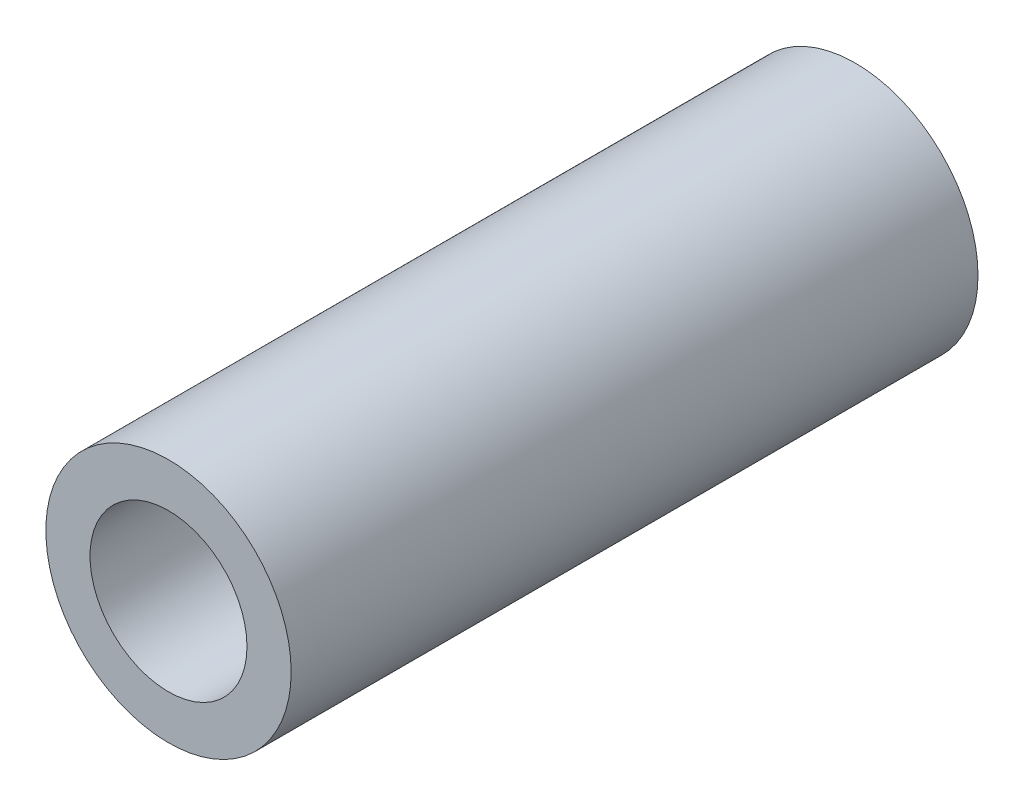
ISO-10303-21;
HEADER;
FILE_DESCRIPTION(('STEP AP214'),'2;1');
FILE_NAME('part.step','',(''),(''),'','','');
FILE_SCHEMA(('AUTOMOTIVE_DESIGN { 1 0 10303 214 1 1 1 1 }'));
ENDSEC;
DATA;
#1=APPLICATION_CONTEXT('core data for automotive mechanical design processes');
#2=APPLICATION_PROTOCOL_DEFINITION('international standard','automotive_design',2000,#1);
#3=PRODUCT_CONTEXT('',#1,'mechanical');
#4=PRODUCT('Part','Part','',(#3));
#5=PRODUCT_RELATED_PRODUCT_CATEGORY('part','',(#4));
#6=PRODUCT_DEFINITION_FORMATION('','',#4);
#7=PRODUCT_DEFINITION_CONTEXT('part definition',#1,'design');
#8=PRODUCT_DEFINITION('design','',#6,#7);
#9=PRODUCT_DEFINITION_SHAPE('','',#8);
#10=(LENGTH_UNIT() NAMED_UNIT(*) SI_UNIT(.MILLI.,.METRE.));
#11=(NAMED_UNIT(*) PLANE_ANGLE_UNIT() SI_UNIT($,.RADIAN.));
#12=(NAMED_UNIT(*) SI_UNIT($,.STERADIAN.) SOLID_ANGLE_UNIT());
#13=UNCERTAINTY_MEASURE_WITH_UNIT(LENGTH_MEASURE(1.E-05),#10,'distance_accuracy_value','');
#14=(GEOMETRIC_REPRESENTATION_CONTEXT(3) GLOBAL_UNCERTAINTY_ASSIGNED_CONTEXT((#13)) GLOBAL_UNIT_ASSIGNED_CONTEXT((#10,
#11,#12)) REPRESENTATION_CONTEXT('',''));
#15=CARTESIAN_POINT('',(0.,0.,0.));
#16=DIRECTION('',(0.,0.,1.));
#17=DIRECTION('',(1.,0.,0.));
#18=AXIS2_PLACEMENT_3D('',#15,#16,#17);
#19=CARTESIAN_POINT('',(0.,0.,14.));
#20=DIRECTION('',(0.,0.,1.));
#21=DIRECTION('',(1.,0.,0.));
#22=AXIS2_PLACEMENT_3D('',#19,#20,#21);
#23=PLANE('',#22);
#24=CARTESIAN_POINT('',(0.,0.,14.));
#25=DIRECTION('',(0.,0.,1.));
#26=DIRECTION('',(1.,0.,0.));
#27=AXIS2_PLACEMENT_3D('',#24,#25,#26);
#28=CIRCLE('',#27,2.5);
#29=CARTESIAN_POINT('',(2.5,0.,14.));
#30=VERTEX_POINT('',#29);
#31=EDGE_CURVE('E10',#30,#30,#28,.T.);
#32=ORIENTED_EDGE('',*,*,#31,.T.);
#33=EDGE_LOOP('',(#32));
#34=FACE_BOUND('',#33,.T.);
#35=CARTESIAN_POINT('',(0.,0.,14.));
#36=DIRECTION('',(0.,0.,1.));
#37=DIRECTION('',(1.,0.,0.));
#38=AXIS2_PLACEMENT_3D('',#35,#36,#37);
#39=CIRCLE('',#38,1.6);
#40=CARTESIAN_POINT('',(1.6,0.,14.));
#41=VERTEX_POINT('',#40);
#42=EDGE_CURVE('E43',#41,#41,#39,.T.);
#43=ORIENTED_EDGE('',*,*,#42,.F.);
#44=EDGE_LOOP('',(#43));
#45=FACE_BOUND('',#44,.T.);
#46=ADVANCED_FACE('F32',(#34,#45),#23,.T.);
#47=CARTESIAN_POINT('',(0.,0.,0.));
#48=DIRECTION('',(0.,0.,1.));
#49=DIRECTION('',(1.,0.,0.));
#50=AXIS2_PLACEMENT_3D('',#47,#48,#49);
#51=PLANE('',#50);
#52=CARTESIAN_POINT('',(0.,0.,0.));
#53=DIRECTION('',(0.,0.,1.));
#54=DIRECTION('',(1.,0.,0.));
#55=AXIS2_PLACEMENT_3D('',#52,#53,#54);
#56=CIRCLE('',#55,2.5);
#57=CARTESIAN_POINT('',(2.5,0.,0.));
#58=VERTEX_POINT('',#57);
#59=EDGE_CURVE('E36',#58,#58,#56,.T.);
#60=ORIENTED_EDGE('',*,*,#59,.F.);
#61=EDGE_LOOP('',(#60));
#62=FACE_BOUND('',#61,.T.);
#63=CARTESIAN_POINT('',(0.,0.,0.));
#64=DIRECTION('',(0.,0.,1.));
#65=DIRECTION('',(1.,0.,0.));
#66=AXIS2_PLACEMENT_3D('',#63,#64,#65);
#67=CIRCLE('',#66,1.6);
#68=CARTESIAN_POINT('',(1.6,0.,0.));
#69=VERTEX_POINT('',#68);
#70=EDGE_CURVE('E45',#69,#69,#67,.T.);
#71=ORIENTED_EDGE('',*,*,#70,.T.);
#72=EDGE_LOOP('',(#71));
#73=FACE_BOUND('',#72,.T.);
#74=ADVANCED_FACE('F55',(#62,#73),#51,.F.);
#75=CARTESIAN_POINT('',(0.,0.,14.));
#76=DIRECTION('',(0.,0.,-1.));
#77=DIRECTION('',(-1.,0.,0.));
#78=AXIS2_PLACEMENT_3D('',#75,#76,#77);
#79=CYLINDRICAL_SURFACE('',#78,2.5);
#80=ORIENTED_EDGE('',*,*,#31,.F.);
#81=EDGE_LOOP('',(#80));
#82=FACE_BOUND('',#81,.T.);
#83=ORIENTED_EDGE('',*,*,#59,.T.);
#84=EDGE_LOOP('',(#83));
#85=FACE_BOUND('',#84,.T.);
#86=ADVANCED_FACE('F34',(#82,#85),#79,.T.);
#87=CARTESIAN_POINT('',(0.,0.,14.));
#88=DIRECTION('',(0.,0.,-1.));
#89=DIRECTION('',(-1.,0.,0.));
#90=AXIS2_PLACEMENT_3D('',#87,#88,#89);
#91=CYLINDRICAL_SURFACE('',#90,1.6);
#92=ORIENTED_EDGE('',*,*,#42,.T.);
#93=EDGE_LOOP('',(#92));
#94=FACE_BOUND('',#93,.T.);
#95=ORIENTED_EDGE('',*,*,#70,.F.);
#96=EDGE_LOOP('',(#95));
#97=FACE_BOUND('',#96,.T.);
#98=ADVANCED_FACE('F51',(#94,#97),#91,.F.);
#99=CLOSED_SHELL('',(#46,#74,#86,#98));
#100=MANIFOLD_SOLID_BREP('B2',#99);
#101=ADVANCED_BREP_SHAPE_REPRESENTATION('',(#18,#100),#14);
#102=SHAPE_DEFINITION_REPRESENTATION(#9,#101);
ENDSEC;
END-ISO-10303-21;
